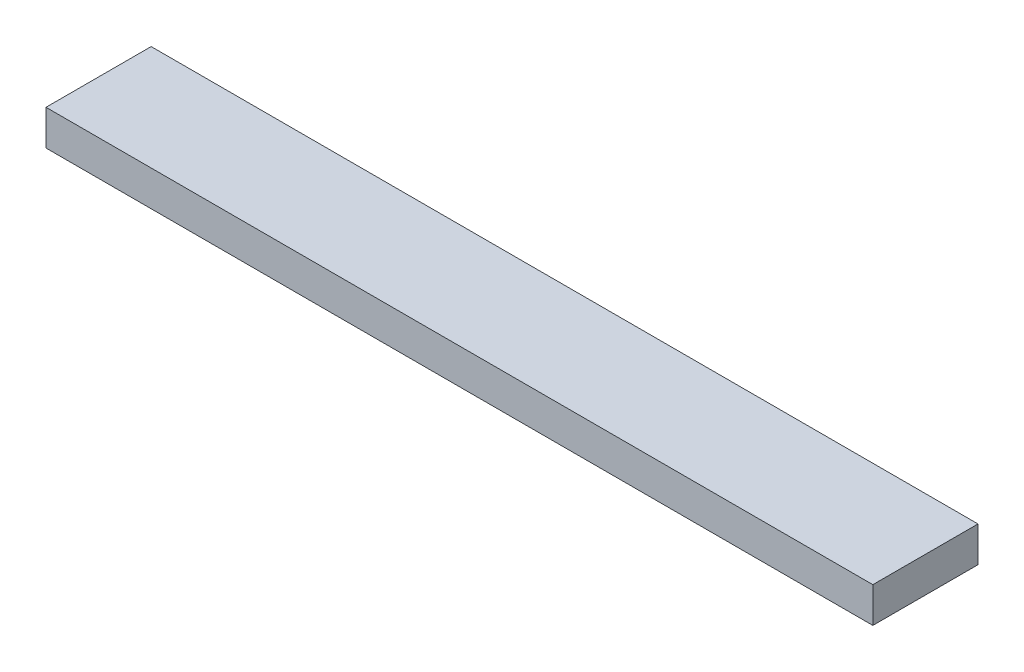
ISO-10303-21;
HEADER;
FILE_DESCRIPTION(('STEP AP214'),'2;1');
FILE_NAME('part.step','',(''),(''),'','','');
FILE_SCHEMA(('AUTOMOTIVE_DESIGN { 1 0 10303 214 1 1 1 1 }'));
ENDSEC;
DATA;
#1=APPLICATION_CONTEXT('core data for automotive mechanical design processes');
#2=APPLICATION_PROTOCOL_DEFINITION('international standard','automotive_design',2000,#1);
#3=PRODUCT_CONTEXT('',#1,'mechanical');
#4=PRODUCT('Part','Part','',(#3));
#5=PRODUCT_RELATED_PRODUCT_CATEGORY('part','',(#4));
#6=PRODUCT_DEFINITION_FORMATION('','',#4);
#7=PRODUCT_DEFINITION_CONTEXT('part definition',#1,'design');
#8=PRODUCT_DEFINITION('design','',#6,#7);
#9=PRODUCT_DEFINITION_SHAPE('','',#8);
#10=(LENGTH_UNIT() NAMED_UNIT(*) SI_UNIT(.MILLI.,.METRE.));
#11=(NAMED_UNIT(*) PLANE_ANGLE_UNIT() SI_UNIT($,.RADIAN.));
#12=(NAMED_UNIT(*) SI_UNIT($,.STERADIAN.) SOLID_ANGLE_UNIT());
#13=UNCERTAINTY_MEASURE_WITH_UNIT(LENGTH_MEASURE(1.E-05),#10,'distance_accuracy_value','');
#14=(GEOMETRIC_REPRESENTATION_CONTEXT(3) GLOBAL_UNCERTAINTY_ASSIGNED_CONTEXT((#13)) GLOBAL_UNIT_ASSIGNED_CONTEXT((#10,
#11,#12)) REPRESENTATION_CONTEXT('',''));
#15=CARTESIAN_POINT('',(0.,0.,0.));
#16=DIRECTION('',(0.,0.,1.));
#17=DIRECTION('',(1.,0.,0.));
#18=AXIS2_PLACEMENT_3D('',#15,#16,#17);
#19=CARTESIAN_POINT('',(257.5,22.,-67.5));
#20=DIRECTION('',(-1.,0.,0.));
#21=DIRECTION('',(0.,0.,1.));
#22=AXIS2_PLACEMENT_3D('',#19,#20,#21);
#23=PLANE('',#22);
#24=DIRECTION('',(0.,0.,-1.));
#25=VECTOR('',#24,1.);
#26=CARTESIAN_POINT('',(257.5,22.,-67.5));
#27=LINE('',#26,#25);
#28=CARTESIAN_POINT('',(257.5,22.,-2.00000000000003));
#29=VERTEX_POINT('',#28);
#30=CARTESIAN_POINT('',(257.5,22.,-67.5));
#31=VERTEX_POINT('',#30);
#32=EDGE_CURVE('E88',#29,#31,#27,.T.);
#33=ORIENTED_EDGE('',*,*,#32,.F.);
#34=DIRECTION('',(0.,1.,0.));
#35=VECTOR('',#34,1.);
#36=CARTESIAN_POINT('',(257.5,0.,-2.00000000000003));
#37=LINE('',#36,#35);
#38=CARTESIAN_POINT('',(257.5,0.,-2.00000000000003));
#39=VERTEX_POINT('',#38);
#40=EDGE_CURVE('E95',#39,#29,#37,.T.);
#41=ORIENTED_EDGE('',*,*,#40,.F.);
#42=DIRECTION('',(0.,0.,-1.));
#43=VECTOR('',#42,1.);
#44=CARTESIAN_POINT('',(257.5,0.,-67.5));
#45=LINE('',#44,#43);
#46=CARTESIAN_POINT('',(257.5,0.,-67.5));
#47=VERTEX_POINT('',#46);
#48=EDGE_CURVE('E80',#39,#47,#45,.T.);
#49=ORIENTED_EDGE('',*,*,#48,.T.);
#50=DIRECTION('',(0.,-1.,0.));
#51=VECTOR('',#50,1.);
#52=CARTESIAN_POINT('',(257.5,22.,-67.5));
#53=LINE('',#52,#51);
#54=EDGE_CURVE('E11',#31,#47,#53,.T.);
#55=ORIENTED_EDGE('',*,*,#54,.F.);
#56=EDGE_LOOP('',(#33,#41,#49,#55));
#57=FACE_BOUND('',#56,.T.);
#58=ADVANCED_FACE('F36',(#57),#23,.F.);
#59=CARTESIAN_POINT('',(-257.5,22.,-67.5));
#60=DIRECTION('',(0.,0.,1.));
#61=DIRECTION('',(1.,0.,0.));
#62=AXIS2_PLACEMENT_3D('',#59,#60,#61);
#63=PLANE('',#62);
#64=DIRECTION('',(-1.,0.,0.));
#65=VECTOR('',#64,1.);
#66=CARTESIAN_POINT('',(-257.5,0.,-67.5));
#67=LINE('',#66,#65);
#68=CARTESIAN_POINT('',(-257.5,0.,-67.5));
#69=VERTEX_POINT('',#68);
#70=EDGE_CURVE('E71',#47,#69,#67,.T.);
#71=ORIENTED_EDGE('',*,*,#70,.T.);
#72=DIRECTION('',(0.,-1.,0.));
#73=VECTOR('',#72,1.);
#74=CARTESIAN_POINT('',(-257.5,22.,-67.5));
#75=LINE('',#74,#73);
#76=CARTESIAN_POINT('',(-257.5,22.,-67.5));
#77=VERTEX_POINT('',#76);
#78=EDGE_CURVE('E43',#77,#69,#75,.T.);
#79=ORIENTED_EDGE('',*,*,#78,.F.);
#80=DIRECTION('',(-1.,0.,0.));
#81=VECTOR('',#80,1.);
#82=CARTESIAN_POINT('',(-257.5,22.,-67.5));
#83=LINE('',#82,#81);
#84=EDGE_CURVE('E59',#31,#77,#83,.T.);
#85=ORIENTED_EDGE('',*,*,#84,.F.);
#86=ORIENTED_EDGE('',*,*,#54,.T.);
#87=EDGE_LOOP('',(#71,#79,#85,#86));
#88=FACE_BOUND('',#87,.T.);
#89=ADVANCED_FACE('F73',(#88),#63,.F.);
#90=CARTESIAN_POINT('',(-257.5,22.,-67.5));
#91=DIRECTION('',(1.,0.,0.));
#92=DIRECTION('',(0.,0.,-1.));
#93=AXIS2_PLACEMENT_3D('',#90,#91,#92);
#94=PLANE('',#93);
#95=DIRECTION('',(0.,0.,1.));
#96=VECTOR('',#95,1.);
#97=CARTESIAN_POINT('',(-257.5,0.,-67.5));
#98=LINE('',#97,#96);
#99=CARTESIAN_POINT('',(-257.5,0.,-2.00000000000003));
#100=VERTEX_POINT('',#99);
#101=EDGE_CURVE('E79',#69,#100,#98,.T.);
#102=ORIENTED_EDGE('',*,*,#101,.T.);
#103=DIRECTION('',(0.,1.,0.));
#104=VECTOR('',#103,1.);
#105=CARTESIAN_POINT('',(-257.5,0.,-2.00000000000003));
#106=LINE('',#105,#104);
#107=CARTESIAN_POINT('',(-257.5,22.,-2.00000000000003));
#108=VERTEX_POINT('',#107);
#109=EDGE_CURVE('E50',#100,#108,#106,.T.);
#110=ORIENTED_EDGE('',*,*,#109,.T.);
#111=DIRECTION('',(0.,0.,1.));
#112=VECTOR('',#111,1.);
#113=CARTESIAN_POINT('',(-257.5,22.,-67.5));
#114=LINE('',#113,#112);
#115=EDGE_CURVE('E85',#77,#108,#114,.T.);
#116=ORIENTED_EDGE('',*,*,#115,.F.);
#117=ORIENTED_EDGE('',*,*,#78,.T.);
#118=EDGE_LOOP('',(#102,#110,#116,#117));
#119=FACE_BOUND('',#118,.T.);
#120=ADVANCED_FACE('F84',(#119),#94,.F.);
#121=CARTESIAN_POINT('',(0.,22.,0.));
#122=DIRECTION('',(0.,1.,0.));
#123=DIRECTION('',(0.,0.,1.));
#124=AXIS2_PLACEMENT_3D('',#121,#122,#123);
#125=PLANE('',#124);
#126=DIRECTION('',(-1.,0.,0.));
#127=VECTOR('',#126,1.);
#128=CARTESIAN_POINT('',(-257.5,22.,-2.00000000000003));
#129=LINE('',#128,#127);
#130=EDGE_CURVE('E99',#29,#108,#129,.T.);
#131=ORIENTED_EDGE('',*,*,#130,.F.);
#132=ORIENTED_EDGE('',*,*,#32,.T.);
#133=ORIENTED_EDGE('',*,*,#84,.T.);
#134=ORIENTED_EDGE('',*,*,#115,.T.);
#135=EDGE_LOOP('',(#131,#132,#133,#134));
#136=FACE_BOUND('',#135,.T.);
#137=ADVANCED_FACE('F107',(#136),#125,.T.);
#138=CARTESIAN_POINT('',(0.,0.,0.));
#139=DIRECTION('',(0.,1.,0.));
#140=DIRECTION('',(0.,0.,1.));
#141=AXIS2_PLACEMENT_3D('',#138,#139,#140);
#142=PLANE('',#141);
#143=ORIENTED_EDGE('',*,*,#48,.F.);
#144=DIRECTION('',(-1.,0.,0.));
#145=VECTOR('',#144,1.);
#146=CARTESIAN_POINT('',(-257.5,0.,-2.00000000000003));
#147=LINE('',#146,#145);
#148=EDGE_CURVE('E87',#39,#100,#147,.T.);
#149=ORIENTED_EDGE('',*,*,#148,.T.);
#150=ORIENTED_EDGE('',*,*,#101,.F.);
#151=ORIENTED_EDGE('',*,*,#70,.F.);
#152=EDGE_LOOP('',(#143,#149,#150,#151));
#153=FACE_BOUND('',#152,.T.);
#154=ADVANCED_FACE('F86',(#153),#142,.F.);
#155=CARTESIAN_POINT('',(-257.5,0.,-2.00000000000003));
#156=DIRECTION('',(0.,0.,-1.));
#157=DIRECTION('',(-1.,0.,0.));
#158=AXIS2_PLACEMENT_3D('',#155,#156,#157);
#159=PLANE('',#158);
#160=ORIENTED_EDGE('',*,*,#130,.T.);
#161=ORIENTED_EDGE('',*,*,#109,.F.);
#162=ORIENTED_EDGE('',*,*,#148,.F.);
#163=ORIENTED_EDGE('',*,*,#40,.T.);
#164=EDGE_LOOP('',(#160,#161,#162,#163));
#165=FACE_BOUND('',#164,.T.);
#166=ADVANCED_FACE('F103',(#165),#159,.F.);
#167=CLOSED_SHELL('',(#58,#89,#120,#137,#154,#166));
#168=MANIFOLD_SOLID_BREP('B2',#167);
#169=ADVANCED_BREP_SHAPE_REPRESENTATION('',(#18,#168),#14);
#170=SHAPE_DEFINITION_REPRESENTATION(#9,#169);
ENDSEC;
END-ISO-10303-21;
